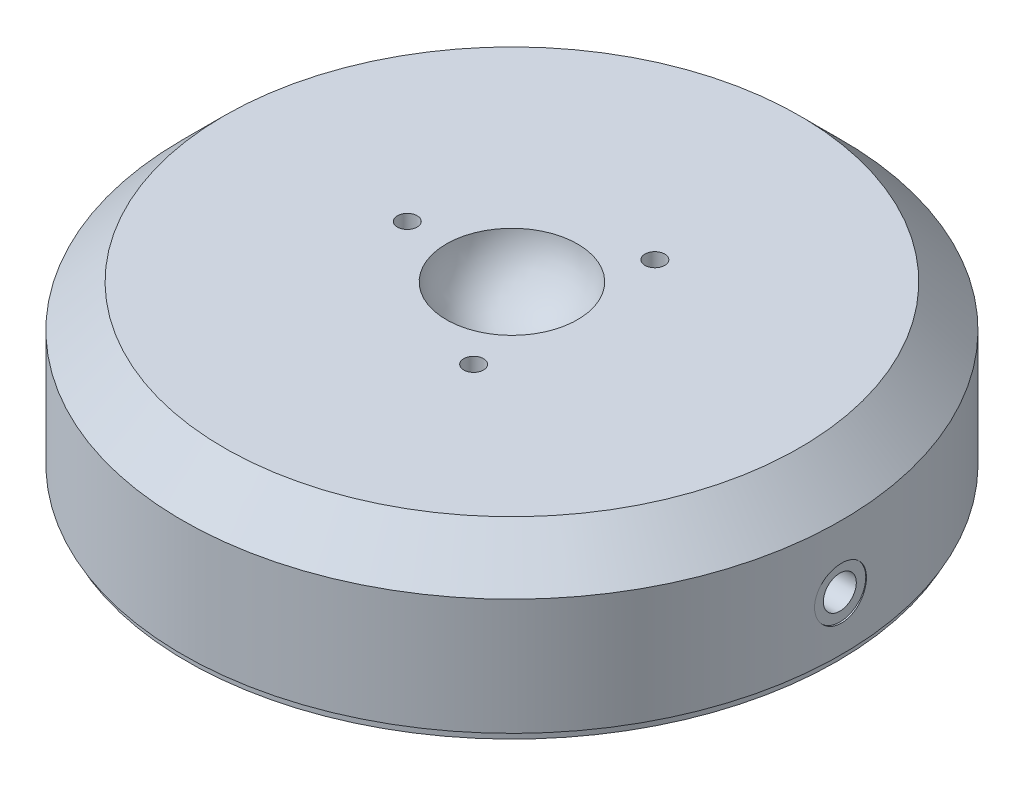
ISO-10303-21;
HEADER;
FILE_DESCRIPTION(('STEP AP214'),'2;1');
FILE_NAME('part.step','',(''),(''),'','','');
FILE_SCHEMA(('AUTOMOTIVE_DESIGN { 1 0 10303 214 1 1 1 1 }'));
ENDSEC;
DATA;
#1=APPLICATION_CONTEXT('core data for automotive mechanical design processes');
#2=APPLICATION_PROTOCOL_DEFINITION('international standard','automotive_design',2000,#1);
#3=PRODUCT_CONTEXT('',#1,'mechanical');
#4=PRODUCT('Part','Part','',(#3));
#5=PRODUCT_RELATED_PRODUCT_CATEGORY('part','',(#4));
#6=PRODUCT_DEFINITION_FORMATION('','',#4);
#7=PRODUCT_DEFINITION_CONTEXT('part definition',#1,'design');
#8=PRODUCT_DEFINITION('design','',#6,#7);
#9=PRODUCT_DEFINITION_SHAPE('','',#8);
#10=(LENGTH_UNIT() NAMED_UNIT(*) SI_UNIT(.MILLI.,.METRE.));
#11=(NAMED_UNIT(*) PLANE_ANGLE_UNIT() SI_UNIT($,.RADIAN.));
#12=(NAMED_UNIT(*) SI_UNIT($,.STERADIAN.) SOLID_ANGLE_UNIT());
#13=UNCERTAINTY_MEASURE_WITH_UNIT(LENGTH_MEASURE(1.E-05),#10,'distance_accuracy_value','');
#14=(GEOMETRIC_REPRESENTATION_CONTEXT(3) GLOBAL_UNCERTAINTY_ASSIGNED_CONTEXT((#13)) GLOBAL_UNIT_ASSIGNED_CONTEXT((#10,
#11,#12)) REPRESENTATION_CONTEXT('',''));
#15=CARTESIAN_POINT('',(0.,0.,0.));
#16=DIRECTION('',(0.,0.,1.));
#17=DIRECTION('',(1.,0.,0.));
#18=AXIS2_PLACEMENT_3D('',#15,#16,#17);
#19=CARTESIAN_POINT('',(0.,0.,0.));
#20=DIRECTION('',(0.,1.,0.));
#21=DIRECTION('',(-1.,0.,0.));
#22=AXIS2_PLACEMENT_3D('',#19,#20,#21);
#23=PLANE('',#22);
#24=CARTESIAN_POINT('',(0.,0.,0.));
#25=DIRECTION('',(0.,1.,0.));
#26=DIRECTION('',(-1.,0.,0.));
#27=AXIS2_PLACEMENT_3D('',#24,#25,#26);
#28=CIRCLE('',#27,49.9999);
#29=CARTESIAN_POINT('',(-49.9999,0.,0.));
#30=VERTEX_POINT('',#29);
#31=EDGE_CURVE('E161',#30,#30,#28,.T.);
#32=ORIENTED_EDGE('',*,*,#31,.F.);
#33=EDGE_LOOP('',(#32));
#34=FACE_BOUND('',#33,.T.);
#35=CARTESIAN_POINT('',(0.,0.,0.));
#36=DIRECTION('',(0.,1.,0.));
#37=DIRECTION('',(-1.,0.,0.));
#38=AXIS2_PLACEMENT_3D('',#35,#36,#37);
#39=CIRCLE('',#38,49.3395);
#40=CARTESIAN_POINT('',(-49.3395,0.,0.));
#41=VERTEX_POINT('',#40);
#42=EDGE_CURVE('E11',#41,#41,#39,.F.);
#43=ORIENTED_EDGE('',*,*,#42,.F.);
#44=EDGE_LOOP('',(#43));
#45=FACE_BOUND('',#44,.T.);
#46=ADVANCED_FACE('F44',(#34,#45),#23,.F.);
#47=CARTESIAN_POINT('',(0.,23.9776,0.));
#48=DIRECTION('',(0.,1.,0.));
#49=DIRECTION('',(-1.,0.,0.));
#50=AXIS2_PLACEMENT_3D('',#47,#48,#49);
#51=CYLINDRICAL_SURFACE('',#50,49.9999);
#52=CARTESIAN_POINT('',(49.8446590018429,8.0772,-3.937));
#53=CARTESIAN_POINT('',(49.8446610634272,7.8564250666835,-3.93699033753928));
#54=CARTESIAN_POINT('',(49.8461415918143,7.63549878199653,-3.91836696554167));
#55=CARTESIAN_POINT('',(49.8519038658948,7.19975590701694,-3.84434723950793));
#56=CARTESIAN_POINT('',(49.8561888067133,6.98494657754693,-3.78890894040672));
#57=CARTESIAN_POINT('',(49.8670715827156,6.5678118903387,-3.64286994327416));
#58=CARTESIAN_POINT('',(49.8736681286094,6.36547964737149,-3.55228884301152));
#59=CARTESIAN_POINT('',(49.8884292310527,5.97894062477123,-3.33856962830171));
#60=CARTESIAN_POINT('',(49.8965934464518,5.79472991476465,-3.21543859505572));
#61=CARTESIAN_POINT('',(49.9135911529193,5.4491888396346,-2.93980714564439));
#62=CARTESIAN_POINT('',(49.9224259774273,5.28790599482453,-2.78724723333083));
#63=CARTESIAN_POINT('',(49.939757187213,4.99320682257434,-2.45721400409654));
#64=CARTESIAN_POINT('',(49.9482535578579,4.85979169891654,-2.27973961151601));
#65=CARTESIAN_POINT('',(49.9639629727042,4.6244592647265,-1.90463464393533));
#66=CARTESIAN_POINT('',(49.9711743501807,4.52258273751676,-1.70697840663986));
#67=CARTESIAN_POINT('',(49.9834869371197,4.3534802953002,-1.2972997083479));
#68=CARTESIAN_POINT('',(49.9885881799947,4.28625383163032,-1.08527747488852));
#69=CARTESIAN_POINT('',(49.9960964240753,4.18849570473212,-0.65335560069216));
#70=CARTESIAN_POINT('',(49.9985090373884,4.15788759636019,-0.433473361101313));
#71=CARTESIAN_POINT('',(50.000387179837,4.13399877103255,0.00832000393002674));
#72=CARTESIAN_POINT('',(49.9998527584968,4.14071742680678,0.230231095213439));
#73=CARTESIAN_POINT('',(49.995901688792,4.19122876947146,0.669264720509774));
#74=CARTESIAN_POINT('',(49.9924914316509,4.23493924693965,0.886396778326128));
#75=CARTESIAN_POINT('',(49.9831797059372,4.35806568568979,1.31023260214878));
#76=CARTESIAN_POINT('',(49.9772782158268,4.4374819556644,1.51693627797983));
#77=CARTESIAN_POINT('',(49.9636370765315,4.62985762792675,1.91430995553782));
#78=CARTESIAN_POINT('',(49.9558954057363,4.74285395544957,2.10496200889367));
#79=CARTESIAN_POINT('',(49.9394442162124,4.9991553733492,2.46462461135547));
#80=CARTESIAN_POINT('',(49.9307346799915,5.14246101154316,2.63363476921238));
#81=CARTESIAN_POINT('',(49.9132990100871,5.45577670447778,2.94569646553813));
#82=CARTESIAN_POINT('',(49.9045728955045,5.62585817422138,3.08867631283434));
#83=CARTESIAN_POINT('',(49.8881113940528,5.98764834228318,3.34406512231985));
#84=CARTESIAN_POINT('',(49.880376007879,6.17935705578174,3.45647406305097));
#85=CARTESIAN_POINT('',(49.8667701705942,6.57900897795544,3.64752687306042));
#86=CARTESIAN_POINT('',(49.8608999155028,6.7869538901476,3.72616719366248));
#87=CARTESIAN_POINT('',(49.8516926016175,7.21315217206165,3.84739825661766));
#88=CARTESIAN_POINT('',(49.8483554953446,7.43140534849339,3.88998967464025));
#89=CARTESIAN_POINT('',(49.8445998256805,7.87139791045192,3.93782351556054));
#90=CARTESIAN_POINT('',(49.8441734562349,8.09312637198706,3.94316583443262));
#91=CARTESIAN_POINT('',(49.8462669224062,8.53432622857991,3.91661134034196));
#92=CARTESIAN_POINT('',(49.8487867335301,8.75379764238631,3.88471483696432));
#93=CARTESIAN_POINT('',(49.8564815121425,9.1839676881036,3.78467132975055));
#94=CARTESIAN_POINT('',(49.8616530757105,9.39467719327044,3.71657079508499));
#95=CARTESIAN_POINT('',(49.8740657998543,9.80167867827107,3.54609954547471));
#96=CARTESIAN_POINT('',(49.8813069901297,9.99797045115685,3.44372833873573));
#97=CARTESIAN_POINT('',(49.8970619754745,10.3710220294921,3.20736829576945));
#98=CARTESIAN_POINT('',(49.9055784394809,10.5477394865841,3.07331280088253));
#99=CARTESIAN_POINT('',(49.9229152571199,10.8761984113137,2.77748597728973));
#100=CARTESIAN_POINT('',(49.9317356154252,11.0279394947094,2.61571422226896));
#101=CARTESIAN_POINT('',(49.9487095222504,11.302478413436,2.26861572475399));
#102=CARTESIAN_POINT('',(49.956861550814,11.4252114076693,2.08323761142382));
#103=CARTESIAN_POINT('',(49.9715583965405,11.6378056114914,1.69444512837671));
#104=CARTESIAN_POINT('',(49.9781032282775,11.7276671191662,1.49103092223584));
#105=CARTESIAN_POINT('',(49.9888412054066,11.8718558007452,1.07217425344035));
#106=CARTESIAN_POINT('',(49.9930370188358,11.9262233007925,0.856745743943826));
#107=CARTESIAN_POINT('',(49.9986149959786,11.9980125152898,0.419783688223333));
#108=CARTESIAN_POINT('',(49.9999972066745,12.0154348466639,0.198250244004395));
#109=CARTESIAN_POINT('',(49.9997923328171,12.0128323045787,-0.243993404384165));
#110=CARTESIAN_POINT('',(49.9982132688978,11.9929085832472,-0.464704214603847));
#111=CARTESIAN_POINT('',(49.9922791705244,11.916390141817,-0.899635099496517));
#112=CARTESIAN_POINT('',(49.9879241319835,11.8597953677323,-1.11385516461352));
#113=CARTESIAN_POINT('',(49.9769269216674,11.7115664187265,-1.52973214398388));
#114=CARTESIAN_POINT('',(49.9702848485224,11.619933754826,-1.73138959956785));
#115=CARTESIAN_POINT('',(49.9554573032519,11.4042421163731,-2.11647415574922));
#116=CARTESIAN_POINT('',(49.9472718593326,11.280183734407,-2.29990158941921));
#117=CARTESIAN_POINT('',(49.9302504158705,11.0027831163862,-2.64383633733173));
#118=CARTESIAN_POINT('',(49.9214127949439,10.8493662745042,-2.80428339729297));
#119=CARTESIAN_POINT('',(49.9040967692234,10.5177331864281,-3.09721135652527));
#120=CARTESIAN_POINT('',(49.8956184521592,10.3395109285917,-3.22968545684449));
#121=CARTESIAN_POINT('',(49.8799651218502,9.96301557741979,-3.46306604776548));
#122=CARTESIAN_POINT('',(49.8727923696247,9.76470860772114,-3.56391798825311));
#123=CARTESIAN_POINT('',(49.8605901388676,9.35405690563134,-3.7307659179182));
#124=CARTESIAN_POINT('',(49.8555581861986,9.14172870746873,-3.79680216508453));
#125=CARTESIAN_POINT('',(49.8495074760876,8.78631347698431,-3.87524071275072));
#126=CARTESIAN_POINT('',(49.847697598705,8.64551529563606,-3.89836986607064));
#127=CARTESIAN_POINT('',(49.8452726974359,8.36223243916402,-3.92925261099813));
#128=CARTESIAN_POINT('',(49.8446576707396,8.21974776800687,-3.93700623876175));
#129=CARTESIAN_POINT('',(49.8446590018429,8.0772,-3.937));
#130=B_SPLINE_CURVE_WITH_KNOTS('',3,(#52,#53,#54,#55,#56,#57,#58,#59,#60,#61,#62,#63,#64,#65,
#66,#67,#68,#69,#70,#71,#72,#73,#74,#75,#76,#77,#78,#79,#80,#81,#82,#83,#84,#85,#86,#87,#88,#89,
#90,#91,#92,#93,#94,#95,#96,#97,#98,#99,#100,#101,#102,#103,#104,#105,#106,#107,#108,#109,#110,
#111,#112,#113,#114,#115,#116,#117,#118,#119,#120,#121,#122,#123,#124,#125,#126,#127,#128,#129),
.UNSPECIFIED.,.T.,.F.,(4,2,2,2,2,2,2,2,2,2,2,2,2,2,2,2,2,2,2,2,2,2,2,2,2,2,2,2,2,2,2,2,2,2,2,2,
2,2,4),(0.,0.66180435154757,1.32436402614628,1.9865547469329,2.64860152725986,3.31200106248385,
3.97542924818666,4.63971177960673,5.30398379218644,5.96686662502363,6.62973831825875,
7.29114072379236,7.95254884755759,8.61468697581727,9.27683707272977,9.9407841116008,
10.6047316165053,11.2687488772504,11.9327536919542,12.5949770673453,13.2571949373786,
13.9185648719751,14.579944297832,15.2427277438179,15.9055213852565,16.569782830998,
17.2340382529202,17.8975376685859,18.561026004806,19.2227198729657,19.8844147152553,
20.5460810249544,21.2077352434205,21.8710937409335,22.5346132855534,23.1992712226141,
23.8631589091693,24.290467180061,24.7177744461223),.UNSPECIFIED.);
#131=CARTESIAN_POINT('',(49.8446590018429,8.0772,-3.937));
#132=VERTEX_POINT('',#131);
#133=EDGE_CURVE('E52',#132,#132,#130,.T.);
#134=ORIENTED_EDGE('',*,*,#133,.T.);
#135=EDGE_LOOP('',(#134));
#136=FACE_BOUND('',#135,.T.);
#137=CARTESIAN_POINT('',(0.,17.6276,0.));
#138=DIRECTION('',(0.,1.,0.));
#139=DIRECTION('',(-1.,0.,0.));
#140=AXIS2_PLACEMENT_3D('',#137,#138,#139);
#141=CIRCLE('',#140,49.9999);
#142=CARTESIAN_POINT('',(-49.9999,17.6276,0.));
#143=VERTEX_POINT('',#142);
#144=EDGE_CURVE('E157',#143,#143,#141,.T.);
#145=ORIENTED_EDGE('',*,*,#144,.F.);
#146=EDGE_LOOP('',(#145));
#147=FACE_BOUND('',#146,.T.);
#148=ORIENTED_EDGE('',*,*,#31,.T.);
#149=EDGE_LOOP('',(#148));
#150=FACE_BOUND('',#149,.T.);
#151=ADVANCED_FACE('F169',(#136,#147,#150),#51,.T.);
#152=CARTESIAN_POINT('',(0.,17.6276,0.));
#153=DIRECTION('',(0.,-1.,0.));
#154=DIRECTION('',(1.,0.,0.));
#155=AXIS2_PLACEMENT_3D('',#152,#153,#154);
#156=CONICAL_SURFACE('',#155,49.9999,0.78539816339745);
#157=CARTESIAN_POINT('',(0.,23.9776,0.));
#158=DIRECTION('',(0.,1.,0.));
#159=DIRECTION('',(-1.,0.,0.));
#160=AXIS2_PLACEMENT_3D('',#157,#158,#159);
#161=CIRCLE('',#160,43.6499);
#162=CARTESIAN_POINT('',(-43.6499,23.9776,0.));
#163=VERTEX_POINT('',#162);
#164=EDGE_CURVE('E153',#163,#163,#161,.T.);
#165=ORIENTED_EDGE('',*,*,#164,.F.);
#166=EDGE_LOOP('',(#165));
#167=FACE_BOUND('',#166,.T.);
#168=ORIENTED_EDGE('',*,*,#144,.T.);
#169=EDGE_LOOP('',(#168));
#170=FACE_BOUND('',#169,.T.);
#171=ADVANCED_FACE('F250',(#167,#170),#156,.T.);
#172=CARTESIAN_POINT('',(43.6499,23.9776,0.));
#173=DIRECTION('',(0.,-1.,0.));
#174=DIRECTION('',(1.,0.,0.));
#175=AXIS2_PLACEMENT_3D('',#172,#173,#174);
#176=PLANE('',#175);
#177=CARTESIAN_POINT('',(7.93749999999987,23.9776,13.748153285078));
#178=DIRECTION('',(0.,1.,0.));
#179=DIRECTION('',(0.,0.,1.));
#180=AXIS2_PLACEMENT_3D('',#177,#178,#179);
#181=CIRCLE('',#180,1.5);
#182=CARTESIAN_POINT('',(7.93749999999987,23.9776,15.248153285078));
#183=VERTEX_POINT('',#182);
#184=EDGE_CURVE('E95',#183,#183,#181,.T.);
#185=ORIENTED_EDGE('',*,*,#184,.F.);
#186=EDGE_LOOP('',(#185));
#187=FACE_BOUND('',#186,.T.);
#188=CARTESIAN_POINT('',(7.93750000000007,23.9776,-13.7481532850779));
#189=DIRECTION('',(0.,1.,0.));
#190=DIRECTION('',(0.,0.,1.));
#191=AXIS2_PLACEMENT_3D('',#188,#189,#190);
#192=CIRCLE('',#191,1.5);
#193=CARTESIAN_POINT('',(7.93750000000007,23.9776,-12.2481532850779));
#194=VERTEX_POINT('',#193);
#195=EDGE_CURVE('E111',#194,#194,#192,.T.);
#196=ORIENTED_EDGE('',*,*,#195,.F.);
#197=EDGE_LOOP('',(#196));
#198=FACE_BOUND('',#197,.T.);
#199=CARTESIAN_POINT('',(-15.875,23.9776,0.));
#200=DIRECTION('',(0.,1.,0.));
#201=DIRECTION('',(0.,0.,1.));
#202=AXIS2_PLACEMENT_3D('',#199,#200,#201);
#203=CIRCLE('',#202,1.5);
#204=CARTESIAN_POINT('',(-15.875,23.9776,1.5));
#205=VERTEX_POINT('',#204);
#206=EDGE_CURVE('E127',#205,#205,#203,.T.);
#207=ORIENTED_EDGE('',*,*,#206,.F.);
#208=EDGE_LOOP('',(#207));
#209=FACE_BOUND('',#208,.T.);
#210=CARTESIAN_POINT('',(0.,23.9776,0.));
#211=DIRECTION('',(0.,1.,0.));
#212=DIRECTION('',(-1.,0.,0.));
#213=AXIS2_PLACEMENT_3D('',#210,#211,#212);
#214=CIRCLE('',#213,9.95589281581517);
#215=CARTESIAN_POINT('',(-9.95589281581517,23.9776,0.));
#216=VERTEX_POINT('',#215);
#217=EDGE_CURVE('E149',#216,#216,#214,.T.);
#218=ORIENTED_EDGE('',*,*,#217,.F.);
#219=EDGE_LOOP('',(#218));
#220=FACE_BOUND('',#219,.T.);
#221=ORIENTED_EDGE('',*,*,#164,.T.);
#222=EDGE_LOOP('',(#221));
#223=FACE_BOUND('',#222,.T.);
#224=ADVANCED_FACE('F247',(#187,#198,#209,#220,#223),#176,.F.);
#225=CARTESIAN_POINT('',(0.,24.9936,0.));
#226=DIRECTION('',(0.,1.,0.));
#227=DIRECTION('',(1.,0.,0.));
#228=AXIS2_PLACEMENT_3D('',#225,#226,#227);
#229=SPHERICAL_SURFACE('',#228,10.0076);
#230=CARTESIAN_POINT('',(0.,15.0574589321608,0.));
#231=DIRECTION('',(0.,1.,0.));
#232=DIRECTION('',(-1.,0.,0.));
#233=AXIS2_PLACEMENT_3D('',#230,#231,#232);
#234=CIRCLE('',#233,1.1938);
#235=CARTESIAN_POINT('',(-1.1938,15.0574589321608,0.));
#236=VERTEX_POINT('',#235);
#237=EDGE_CURVE('E146',#236,#236,#234,.T.);
#238=ORIENTED_EDGE('',*,*,#237,.F.);
#239=EDGE_LOOP('',(#238));
#240=FACE_BOUND('',#239,.T.);
#241=ORIENTED_EDGE('',*,*,#217,.T.);
#242=EDGE_LOOP('',(#241));
#243=FACE_BOUND('',#242,.T.);
#244=ADVANCED_FACE('F243',(#240,#243),#229,.F.);
#245=CARTESIAN_POINT('',(0.,23.9776,0.));
#246=DIRECTION('',(0.,1.,0.));
#247=DIRECTION('',(-1.,0.,0.));
#248=AXIS2_PLACEMENT_3D('',#245,#246,#247);
#249=CYLINDRICAL_SURFACE('',#248,1.1938);
#250=CARTESIAN_POINT('',(0.,14.5796,0.));
#251=DIRECTION('',(0.,1.,0.));
#252=DIRECTION('',(-1.,0.,0.));
#253=AXIS2_PLACEMENT_3D('',#250,#251,#252);
#254=CIRCLE('',#253,1.1938);
#255=CARTESIAN_POINT('',(-1.1938,14.5796,0.));
#256=VERTEX_POINT('',#255);
#257=EDGE_CURVE('E142',#256,#256,#254,.T.);
#258=ORIENTED_EDGE('',*,*,#257,.F.);
#259=EDGE_LOOP('',(#258));
#260=FACE_BOUND('',#259,.T.);
#261=ORIENTED_EDGE('',*,*,#237,.T.);
#262=EDGE_LOOP('',(#261));
#263=FACE_BOUND('',#262,.T.);
#264=ADVANCED_FACE('F239',(#260,#263),#249,.F.);
#265=CARTESIAN_POINT('',(0.,14.5796,0.));
#266=DIRECTION('',(0.,-1.,0.));
#267=DIRECTION('',(1.,0.,0.));
#268=AXIS2_PLACEMENT_3D('',#265,#266,#267);
#269=PLANE('',#268);
#270=ORIENTED_EDGE('',*,*,#257,.T.);
#271=EDGE_LOOP('',(#270));
#272=FACE_BOUND('',#271,.T.);
#273=ADVANCED_FACE('F219',(#272),#269,.F.);
#274=CARTESIAN_POINT('',(-15.875,23.9776,0.));
#275=DIRECTION('',(0.,1.,0.));
#276=DIRECTION('',(0.,0.,1.));
#277=AXIS2_PLACEMENT_3D('',#274,#275,#276);
#278=CYLINDRICAL_SURFACE('',#277,1.5);
#279=CARTESIAN_POINT('',(-15.875,17.9832,0.));
#280=DIRECTION('',(0.,1.,0.));
#281=DIRECTION('',(0.,0.,1.));
#282=AXIS2_PLACEMENT_3D('',#279,#280,#281);
#283=CIRCLE('',#282,1.5);
#284=CARTESIAN_POINT('',(-15.875,17.9832,1.5));
#285=VERTEX_POINT('',#284);
#286=EDGE_CURVE('E123',#285,#285,#283,.T.);
#287=ORIENTED_EDGE('',*,*,#286,.F.);
#288=EDGE_LOOP('',(#287));
#289=FACE_BOUND('',#288,.T.);
#290=ORIENTED_EDGE('',*,*,#206,.T.);
#291=EDGE_LOOP('',(#290));
#292=FACE_BOUND('',#291,.T.);
#293=ADVANCED_FACE('F215',(#289,#292),#278,.F.);
#294=CARTESIAN_POINT('',(-14.625,17.9832,0.));
#295=DIRECTION('',(0.,-1.,0.));
#296=DIRECTION('',(0.,0.,-1.));
#297=AXIS2_PLACEMENT_3D('',#294,#295,#296);
#298=PLANE('',#297);
#299=CARTESIAN_POINT('',(-15.875,17.9832,0.));
#300=DIRECTION('',(0.,1.,0.));
#301=DIRECTION('',(0.,0.,1.));
#302=AXIS2_PLACEMENT_3D('',#299,#300,#301);
#303=CIRCLE('',#302,1.25);
#304=CARTESIAN_POINT('',(-15.875,17.9832,1.25));
#305=VERTEX_POINT('',#304);
#306=EDGE_CURVE('E119',#305,#305,#303,.T.);
#307=ORIENTED_EDGE('',*,*,#306,.F.);
#308=EDGE_LOOP('',(#307));
#309=FACE_BOUND('',#308,.T.);
#310=ORIENTED_EDGE('',*,*,#286,.T.);
#311=EDGE_LOOP('',(#310));
#312=FACE_BOUND('',#311,.T.);
#313=ADVANCED_FACE('F211',(#309,#312),#298,.F.);
#314=CARTESIAN_POINT('',(-15.875,23.9776,0.));
#315=DIRECTION('',(0.,1.,0.));
#316=DIRECTION('',(0.,0.,1.));
#317=AXIS2_PLACEMENT_3D('',#314,#315,#316);
#318=CYLINDRICAL_SURFACE('',#317,1.25);
#319=CARTESIAN_POINT('',(-15.875,14.3256,0.));
#320=DIRECTION('',(0.,1.,0.));
#321=DIRECTION('',(0.,0.,1.));
#322=AXIS2_PLACEMENT_3D('',#319,#320,#321);
#323=CIRCLE('',#322,1.25);
#324=CARTESIAN_POINT('',(-15.875,14.3256,1.25));
#325=VERTEX_POINT('',#324);
#326=EDGE_CURVE('E115',#325,#325,#323,.T.);
#327=ORIENTED_EDGE('',*,*,#326,.F.);
#328=EDGE_LOOP('',(#327));
#329=FACE_BOUND('',#328,.T.);
#330=ORIENTED_EDGE('',*,*,#306,.T.);
#331=EDGE_LOOP('',(#330));
#332=FACE_BOUND('',#331,.T.);
#333=ADVANCED_FACE('F208',(#329,#332),#318,.F.);
#334=CARTESIAN_POINT('',(-15.875,14.3256,0.));
#335=DIRECTION('',(0.,1.,0.));
#336=DIRECTION('',(0.,0.,1.));
#337=AXIS2_PLACEMENT_3D('',#334,#335,#336);
#338=CONICAL_SURFACE('',#337,1.25,1.02974425867665);
#339=CARTESIAN_POINT('',(-15.875,13.5745242262155,0.));
#340=VERTEX_POINT('',#339);
#341=VERTEX_LOOP('',#340);
#342=FACE_BOUND('',#341,.T.);
#343=ORIENTED_EDGE('',*,*,#326,.T.);
#344=EDGE_LOOP('',(#343));
#345=FACE_BOUND('',#344,.T.);
#346=ADVANCED_FACE('F204',(#342,#345),#338,.F.);
#347=CARTESIAN_POINT('',(7.93750000000007,23.9776,-13.7481532850779));
#348=DIRECTION('',(0.,1.,0.));
#349=DIRECTION('',(0.,0.,1.));
#350=AXIS2_PLACEMENT_3D('',#347,#348,#349);
#351=CYLINDRICAL_SURFACE('',#350,1.5);
#352=CARTESIAN_POINT('',(7.93750000000007,17.9832,-13.7481532850779));
#353=DIRECTION('',(0.,1.,0.));
#354=DIRECTION('',(0.,0.,1.));
#355=AXIS2_PLACEMENT_3D('',#352,#353,#354);
#356=CIRCLE('',#355,1.5);
#357=CARTESIAN_POINT('',(7.93750000000007,17.9832,-12.2481532850779));
#358=VERTEX_POINT('',#357);
#359=EDGE_CURVE('E107',#358,#358,#356,.T.);
#360=ORIENTED_EDGE('',*,*,#359,.F.);
#361=EDGE_LOOP('',(#360));
#362=FACE_BOUND('',#361,.T.);
#363=ORIENTED_EDGE('',*,*,#195,.T.);
#364=EDGE_LOOP('',(#363));
#365=FACE_BOUND('',#364,.T.);
#366=ADVANCED_FACE('F200',(#362,#365),#351,.F.);
#367=CARTESIAN_POINT('',(9.18750000000006,17.9832,-13.7481532850779));
#368=DIRECTION('',(0.,-1.,0.));
#369=DIRECTION('',(0.,0.,-1.));
#370=AXIS2_PLACEMENT_3D('',#367,#368,#369);
#371=PLANE('',#370);
#372=CARTESIAN_POINT('',(7.93750000000007,17.9832,-13.7481532850779));
#373=DIRECTION('',(0.,1.,0.));
#374=DIRECTION('',(0.,0.,1.));
#375=AXIS2_PLACEMENT_3D('',#372,#373,#374);
#376=CIRCLE('',#375,1.25);
#377=CARTESIAN_POINT('',(7.93750000000007,17.9832,-12.4981532850779));
#378=VERTEX_POINT('',#377);
#379=EDGE_CURVE('E103',#378,#378,#376,.T.);
#380=ORIENTED_EDGE('',*,*,#379,.F.);
#381=EDGE_LOOP('',(#380));
#382=FACE_BOUND('',#381,.T.);
#383=ORIENTED_EDGE('',*,*,#359,.T.);
#384=EDGE_LOOP('',(#383));
#385=FACE_BOUND('',#384,.T.);
#386=ADVANCED_FACE('F196',(#382,#385),#371,.F.);
#387=CARTESIAN_POINT('',(7.93750000000007,23.9776,-13.7481532850779));
#388=DIRECTION('',(0.,1.,0.));
#389=DIRECTION('',(0.,0.,1.));
#390=AXIS2_PLACEMENT_3D('',#387,#388,#389);
#391=CYLINDRICAL_SURFACE('',#390,1.25);
#392=CARTESIAN_POINT('',(7.93750000000007,14.3256,-13.7481532850779));
#393=DIRECTION('',(0.,1.,0.));
#394=DIRECTION('',(0.,0.,1.));
#395=AXIS2_PLACEMENT_3D('',#392,#393,#394);
#396=CIRCLE('',#395,1.25);
#397=CARTESIAN_POINT('',(7.93750000000007,14.3256,-12.4981532850779));
#398=VERTEX_POINT('',#397);
#399=EDGE_CURVE('E99',#398,#398,#396,.T.);
#400=ORIENTED_EDGE('',*,*,#399,.F.);
#401=EDGE_LOOP('',(#400));
#402=FACE_BOUND('',#401,.T.);
#403=ORIENTED_EDGE('',*,*,#379,.T.);
#404=EDGE_LOOP('',(#403));
#405=FACE_BOUND('',#404,.T.);
#406=ADVANCED_FACE('F192',(#402,#405),#391,.F.);
#407=CARTESIAN_POINT('',(7.93750000000007,14.3256,-13.7481532850779));
#408=DIRECTION('',(0.,1.,0.));
#409=DIRECTION('',(0.,0.,1.));
#410=AXIS2_PLACEMENT_3D('',#407,#408,#409);
#411=CONICAL_SURFACE('',#410,1.25,1.02974425867665);
#412=CARTESIAN_POINT('',(7.93750000000006,13.5745242262155,-13.7481532850779));
#413=VERTEX_POINT('',#412);
#414=VERTEX_LOOP('',#413);
#415=FACE_BOUND('',#414,.T.);
#416=ORIENTED_EDGE('',*,*,#399,.T.);
#417=EDGE_LOOP('',(#416));
#418=FACE_BOUND('',#417,.T.);
#419=ADVANCED_FACE('F188',(#415,#418),#411,.F.);
#420=CARTESIAN_POINT('',(7.93749999999987,23.9776,13.748153285078));
#421=DIRECTION('',(0.,1.,0.));
#422=DIRECTION('',(0.,0.,1.));
#423=AXIS2_PLACEMENT_3D('',#420,#421,#422);
#424=CYLINDRICAL_SURFACE('',#423,1.5);
#425=CARTESIAN_POINT('',(7.93749999999987,17.9832,13.748153285078));
#426=DIRECTION('',(0.,1.,0.));
#427=DIRECTION('',(0.,0.,1.));
#428=AXIS2_PLACEMENT_3D('',#425,#426,#427);
#429=CIRCLE('',#428,1.5);
#430=CARTESIAN_POINT('',(7.93749999999987,17.9832,15.248153285078));
#431=VERTEX_POINT('',#430);
#432=EDGE_CURVE('E83',#431,#431,#429,.T.);
#433=ORIENTED_EDGE('',*,*,#432,.F.);
#434=EDGE_LOOP('',(#433));
#435=FACE_BOUND('',#434,.T.);
#436=ORIENTED_EDGE('',*,*,#184,.T.);
#437=EDGE_LOOP('',(#436));
#438=FACE_BOUND('',#437,.T.);
#439=ADVANCED_FACE('F184',(#435,#438),#424,.F.);
#440=CARTESIAN_POINT('',(9.18749999999987,17.9832,13.748153285078));
#441=DIRECTION('',(0.,-1.,0.));
#442=DIRECTION('',(0.,0.,-1.));
#443=AXIS2_PLACEMENT_3D('',#440,#441,#442);
#444=PLANE('',#443);
#445=CARTESIAN_POINT('',(7.93749999999987,17.9832,13.748153285078));
#446=DIRECTION('',(0.,1.,0.));
#447=DIRECTION('',(0.,0.,1.));
#448=AXIS2_PLACEMENT_3D('',#445,#446,#447);
#449=CIRCLE('',#448,1.25);
#450=CARTESIAN_POINT('',(7.93749999999987,17.9832,14.998153285078));
#451=VERTEX_POINT('',#450);
#452=EDGE_CURVE('E76',#451,#451,#449,.T.);
#453=ORIENTED_EDGE('',*,*,#452,.F.);
#454=EDGE_LOOP('',(#453));
#455=FACE_BOUND('',#454,.T.);
#456=ORIENTED_EDGE('',*,*,#432,.T.);
#457=EDGE_LOOP('',(#456));
#458=FACE_BOUND('',#457,.T.);
#459=ADVANCED_FACE('F181',(#455,#458),#444,.F.);
#460=CARTESIAN_POINT('',(7.93749999999987,23.9776,13.748153285078));
#461=DIRECTION('',(0.,1.,0.));
#462=DIRECTION('',(0.,0.,1.));
#463=AXIS2_PLACEMENT_3D('',#460,#461,#462);
#464=CYLINDRICAL_SURFACE('',#463,1.25);
#465=CARTESIAN_POINT('',(7.93749999999987,14.3256,13.748153285078));
#466=DIRECTION('',(0.,1.,0.));
#467=DIRECTION('',(0.,0.,1.));
#468=AXIS2_PLACEMENT_3D('',#465,#466,#467);
#469=CIRCLE('',#468,1.25);
#470=CARTESIAN_POINT('',(7.93749999999987,14.3256,14.998153285078));
#471=VERTEX_POINT('',#470);
#472=EDGE_CURVE('E73',#471,#471,#469,.T.);
#473=ORIENTED_EDGE('',*,*,#472,.F.);
#474=EDGE_LOOP('',(#473));
#475=FACE_BOUND('',#474,.T.);
#476=ORIENTED_EDGE('',*,*,#452,.T.);
#477=EDGE_LOOP('',(#476));
#478=FACE_BOUND('',#477,.T.);
#479=ADVANCED_FACE('F69',(#475,#478),#464,.F.);
#480=CARTESIAN_POINT('',(7.93749999999987,14.3256,13.748153285078));
#481=DIRECTION('',(0.,1.,0.));
#482=DIRECTION('',(0.,0.,1.));
#483=AXIS2_PLACEMENT_3D('',#480,#481,#482);
#484=CONICAL_SURFACE('',#483,1.25,1.02974425867665);
#485=CARTESIAN_POINT('',(7.93749999999987,13.5745242262155,13.748153285078));
#486=VERTEX_POINT('',#485);
#487=VERTEX_LOOP('',#486);
#488=FACE_BOUND('',#487,.T.);
#489=ORIENTED_EDGE('',*,*,#472,.T.);
#490=EDGE_LOOP('',(#489));
#491=FACE_BOUND('',#490,.T.);
#492=ADVANCED_FACE('F65',(#488,#491),#484,.F.);
#493=CARTESIAN_POINT('',(49.9999,8.0772,0.));
#494=DIRECTION('',(1.,0.,0.));
#495=DIRECTION('',(0.,0.,-1.));
#496=AXIS2_PLACEMENT_3D('',#493,#494,#495);
#497=CYLINDRICAL_SURFACE('',#496,3.937);
#498=CARTESIAN_POINT('',(49.7459,8.0772,0.));
#499=DIRECTION('',(1.,0.,0.));
#500=DIRECTION('',(0.,0.,-1.));
#501=AXIS2_PLACEMENT_3D('',#498,#499,#500);
#502=CIRCLE('',#501,3.937);
#503=CARTESIAN_POINT('',(49.7459,8.0772,-3.937));
#504=VERTEX_POINT('',#503);
#505=EDGE_CURVE('E87',#504,#504,#502,.T.);
#506=ORIENTED_EDGE('',*,*,#505,.F.);
#507=EDGE_LOOP('',(#506));
#508=FACE_BOUND('',#507,.T.);
#509=ORIENTED_EDGE('',*,*,#133,.F.);
#510=EDGE_LOOP('',(#509));
#511=FACE_BOUND('',#510,.T.);
#512=ADVANCED_FACE('F68',(#508,#511),#497,.F.);
#513=CARTESIAN_POINT('',(49.7459,8.7757,0.));
#514=DIRECTION('',(-1.,0.,0.));
#515=DIRECTION('',(0.,0.,1.));
#516=AXIS2_PLACEMENT_3D('',#513,#514,#515);
#517=PLANE('',#516);
#518=ORIENTED_EDGE('',*,*,#505,.T.);
#519=EDGE_LOOP('',(#518));
#520=FACE_BOUND('',#519,.T.);
#521=CARTESIAN_POINT('',(49.7459,8.0772,0.));
#522=DIRECTION('',(-1.,0.,0.));
#523=DIRECTION('',(0.,0.,1.));
#524=AXIS2_PLACEMENT_3D('',#521,#522,#523);
#525=CIRCLE('',#524,2.5);
#526=CARTESIAN_POINT('',(49.7459,8.0772,2.5));
#527=VERTEX_POINT('',#526);
#528=EDGE_CURVE('E77',#527,#527,#525,.F.);
#529=ORIENTED_EDGE('',*,*,#528,.F.);
#530=EDGE_LOOP('',(#529));
#531=FACE_BOUND('',#530,.T.);
#532=ADVANCED_FACE('F175',(#520,#531),#517,.F.);
#533=CARTESIAN_POINT('',(3.0099,8.0772,0.));
#534=DIRECTION('',(1.,0.,0.));
#535=DIRECTION('',(0.,0.,-1.));
#536=AXIS2_PLACEMENT_3D('',#533,#534,#535);
#537=CONICAL_SURFACE('',#536,2.09999999999999,1.02974425867665);
#538=CARTESIAN_POINT('',(1.74809270004213,8.07719999999998,0.));
#539=VERTEX_POINT('',#538);
#540=VERTEX_LOOP('',#539);
#541=FACE_BOUND('',#540,.T.);
#542=CARTESIAN_POINT('',(3.0099,8.0772,0.));
#543=DIRECTION('',(1.,0.,0.));
#544=DIRECTION('',(0.,0.,-1.));
#545=AXIS2_PLACEMENT_3D('',#542,#543,#544);
#546=CIRCLE('',#545,2.09999999999999);
#547=CARTESIAN_POINT('',(3.0099,8.0772,-2.09999999999999));
#548=VERTEX_POINT('',#547);
#549=EDGE_CURVE('E131',#548,#548,#546,.T.);
#550=ORIENTED_EDGE('',*,*,#549,.T.);
#551=EDGE_LOOP('',(#550));
#552=FACE_BOUND('',#551,.T.);
#553=ADVANCED_FACE('F221',(#541,#552),#537,.F.);
#554=CARTESIAN_POINT('',(49.9999,8.0772,0.));
#555=DIRECTION('',(1.,0.,0.));
#556=DIRECTION('',(0.,0.,-1.));
#557=AXIS2_PLACEMENT_3D('',#554,#555,#556);
#558=CYLINDRICAL_SURFACE('',#557,2.09999999999999);
#559=ORIENTED_EDGE('',*,*,#549,.F.);
#560=EDGE_LOOP('',(#559));
#561=FACE_BOUND('',#560,.T.);
#562=CARTESIAN_POINT('',(42.3799,8.0772,0.));
#563=DIRECTION('',(1.,0.,0.));
#564=DIRECTION('',(0.,0.,-1.));
#565=AXIS2_PLACEMENT_3D('',#562,#563,#564);
#566=CIRCLE('',#565,2.1);
#567=CARTESIAN_POINT('',(42.3799,8.0772,-2.1));
#568=VERTEX_POINT('',#567);
#569=EDGE_CURVE('E135',#568,#568,#566,.T.);
#570=ORIENTED_EDGE('',*,*,#569,.T.);
#571=EDGE_LOOP('',(#570));
#572=FACE_BOUND('',#571,.T.);
#573=ADVANCED_FACE('F224',(#561,#572),#558,.F.);
#574=CARTESIAN_POINT('',(42.3799,10.1772,0.));
#575=DIRECTION('',(-1.,0.,0.));
#576=DIRECTION('',(0.,0.,1.));
#577=AXIS2_PLACEMENT_3D('',#574,#575,#576);
#578=PLANE('',#577);
#579=ORIENTED_EDGE('',*,*,#569,.F.);
#580=EDGE_LOOP('',(#579));
#581=FACE_BOUND('',#580,.T.);
#582=CARTESIAN_POINT('',(42.3799,8.0772,0.));
#583=DIRECTION('',(1.,0.,0.));
#584=DIRECTION('',(0.,0.,-1.));
#585=AXIS2_PLACEMENT_3D('',#582,#583,#584);
#586=CIRCLE('',#585,2.5);
#587=CARTESIAN_POINT('',(42.3799,8.0772,-2.5));
#588=VERTEX_POINT('',#587);
#589=EDGE_CURVE('E139',#588,#588,#586,.T.);
#590=ORIENTED_EDGE('',*,*,#589,.T.);
#591=EDGE_LOOP('',(#590));
#592=FACE_BOUND('',#591,.T.);
#593=ADVANCED_FACE('F227',(#581,#592),#578,.F.);
#594=CARTESIAN_POINT('',(49.9999,8.0772,0.));
#595=DIRECTION('',(1.,0.,0.));
#596=DIRECTION('',(0.,0.,-1.));
#597=AXIS2_PLACEMENT_3D('',#594,#595,#596);
#598=CYLINDRICAL_SURFACE('',#597,2.5);
#599=ORIENTED_EDGE('',*,*,#528,.T.);
#600=EDGE_LOOP('',(#599));
#601=FACE_BOUND('',#600,.T.);
#602=ORIENTED_EDGE('',*,*,#589,.F.);
#603=EDGE_LOOP('',(#602));
#604=FACE_BOUND('',#603,.T.);
#605=ADVANCED_FACE('F231',(#601,#604),#598,.F.);
#606=CARTESIAN_POINT('',(0.,-1.2192,0.));
#607=DIRECTION('',(0.,1.,0.));
#608=DIRECTION('',(-1.,0.,0.));
#609=AXIS2_PLACEMENT_3D('',#606,#607,#608);
#610=CYLINDRICAL_SURFACE('',#609,49.3395);
#611=CARTESIAN_POINT('',(0.,-1.2192,0.));
#612=DIRECTION('',(0.,-1.,0.));
#613=DIRECTION('',(1.,0.,0.));
#614=AXIS2_PLACEMENT_3D('',#611,#612,#613);
#615=CIRCLE('',#614,49.3395);
#616=CARTESIAN_POINT('',(49.3395,-1.2192,0.));
#617=VERTEX_POINT('',#616);
#618=EDGE_CURVE('E278',#617,#617,#615,.T.);
#619=ORIENTED_EDGE('',*,*,#618,.F.);
#620=EDGE_LOOP('',(#619));
#621=FACE_BOUND('',#620,.T.);
#622=ORIENTED_EDGE('',*,*,#42,.T.);
#623=EDGE_LOOP('',(#622));
#624=FACE_BOUND('',#623,.T.);
#625=ADVANCED_FACE('F235',(#621,#624),#610,.T.);
#626=CARTESIAN_POINT('',(0.,-1.2192,0.));
#627=DIRECTION('',(0.,-1.,0.));
#628=DIRECTION('',(1.,0.,0.));
#629=AXIS2_PLACEMENT_3D('',#626,#627,#628);
#630=PLANE('',#629);
#631=ORIENTED_EDGE('',*,*,#618,.T.);
#632=EDGE_LOOP('',(#631));
#633=FACE_BOUND('',#632,.T.);
#634=ADVANCED_FACE('F269',(#633),#630,.T.);
#635=CLOSED_SHELL('',(#46,#151,#171,#224,#244,#264,#273,#293,#313,#333,#346,#366,#386,#406,#419,
#439,#459,#479,#492,#512,#532,#553,#573,#593,#605,#625,#634));
#636=MANIFOLD_SOLID_BREP('B2',#635);
#637=ADVANCED_BREP_SHAPE_REPRESENTATION('',(#18,#636),#14);
#638=SHAPE_DEFINITION_REPRESENTATION(#9,#637);
ENDSEC;
END-ISO-10303-21;
